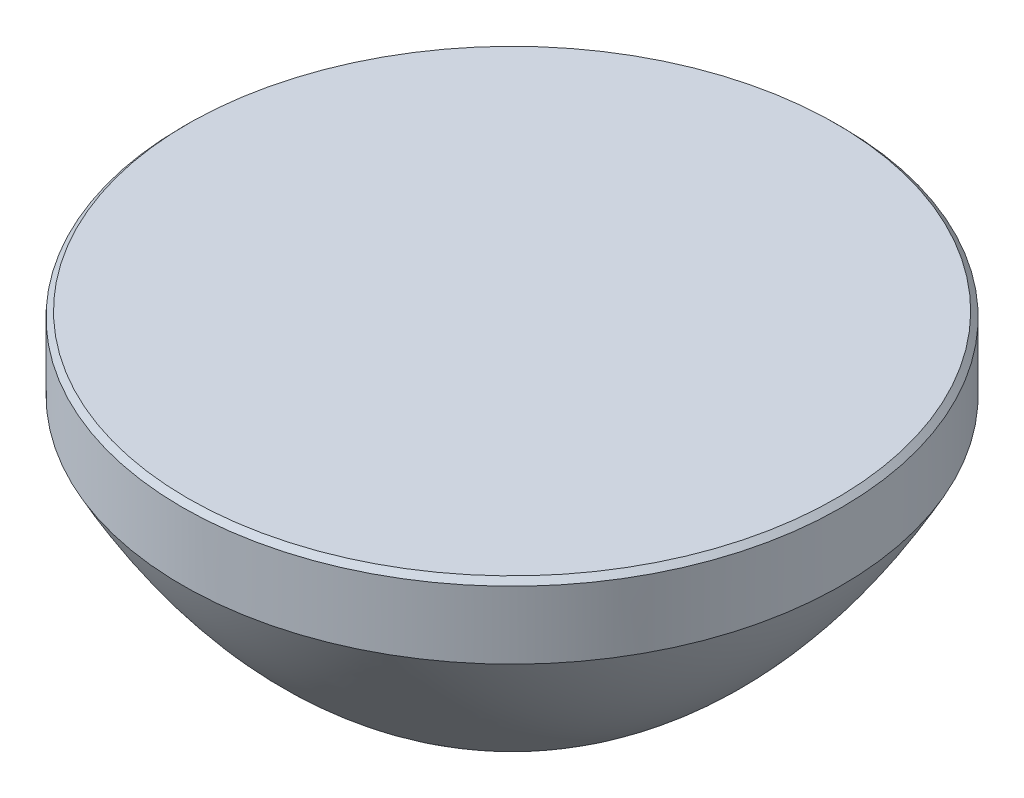
ISO-10303-21;
HEADER;
FILE_DESCRIPTION(('STEP AP214'),'2;1');
FILE_NAME('part.step','',(''),(''),'','','');
FILE_SCHEMA(('AUTOMOTIVE_DESIGN { 1 0 10303 214 1 1 1 1 }'));
ENDSEC;
DATA;
#1=APPLICATION_CONTEXT('core data for automotive mechanical design processes');
#2=APPLICATION_PROTOCOL_DEFINITION('international standard','automotive_design',2000,#1);
#3=PRODUCT_CONTEXT('',#1,'mechanical');
#4=PRODUCT('Part','Part','',(#3));
#5=PRODUCT_RELATED_PRODUCT_CATEGORY('part','',(#4));
#6=PRODUCT_DEFINITION_FORMATION('','',#4);
#7=PRODUCT_DEFINITION_CONTEXT('part definition',#1,'design');
#8=PRODUCT_DEFINITION('design','',#6,#7);
#9=PRODUCT_DEFINITION_SHAPE('','',#8);
#10=(LENGTH_UNIT() NAMED_UNIT(*) SI_UNIT(.MILLI.,.METRE.));
#11=(NAMED_UNIT(*) PLANE_ANGLE_UNIT() SI_UNIT($,.RADIAN.));
#12=(NAMED_UNIT(*) SI_UNIT($,.STERADIAN.) SOLID_ANGLE_UNIT());
#13=UNCERTAINTY_MEASURE_WITH_UNIT(LENGTH_MEASURE(1.E-05),#10,'distance_accuracy_value','');
#14=(GEOMETRIC_REPRESENTATION_CONTEXT(3) GLOBAL_UNCERTAINTY_ASSIGNED_CONTEXT((#13)) GLOBAL_UNIT_ASSIGNED_CONTEXT((#10,
#11,#12)) REPRESENTATION_CONTEXT('',''));
#15=CARTESIAN_POINT('',(0.,0.,0.));
#16=DIRECTION('',(0.,0.,1.));
#17=DIRECTION('',(1.,0.,0.));
#18=AXIS2_PLACEMENT_3D('',#15,#16,#17);
#19=CARTESIAN_POINT('',(0.,-6.,0.));
#20=DIRECTION('',(0.,-1.,0.));
#21=DIRECTION('',(0.,0.,-1.));
#22=AXIS2_PLACEMENT_3D('',#19,#20,#21);
#23=CYLINDRICAL_SURFACE('',#22,12.4999999999542);
#24=CARTESIAN_POINT('',(0.,5.79999999990704,0.));
#25=DIRECTION('',(0.,1.,0.));
#26=DIRECTION('',(0.,0.,1.));
#27=AXIS2_PLACEMENT_3D('',#24,#25,#26);
#28=CIRCLE('',#27,12.4999999999542);
#29=CARTESIAN_POINT('',(0.,5.79999999990704,12.4999999999542));
#30=VERTEX_POINT('',#29);
#31=EDGE_CURVE('E22',#30,#30,#28,.F.);
#32=ORIENTED_EDGE('',*,*,#31,.T.);
#33=EDGE_LOOP('',(#32));
#34=FACE_BOUND('',#33,.T.);
#35=CARTESIAN_POINT('',(0.,3.23934700389114,0.));
#36=DIRECTION('',(0.,-1.,0.));
#37=DIRECTION('',(0.,0.,-1.));
#38=AXIS2_PLACEMENT_3D('',#35,#36,#37);
#39=CIRCLE('',#38,12.5000000000471);
#40=CARTESIAN_POINT('',(0.,3.23934700389114,-12.5000000000471));
#41=VERTEX_POINT('',#40);
#42=EDGE_CURVE('E44',#41,#41,#39,.T.);
#43=ORIENTED_EDGE('',*,*,#42,.F.);
#44=EDGE_LOOP('',(#43));
#45=FACE_BOUND('',#44,.T.);
#46=ADVANCED_FACE('F15',(#34,#45),#23,.T.);
#47=CARTESIAN_POINT('',(0.,-6.,-3.46050642845213E-11));
#48=CARTESIAN_POINT('',(0.,-5.99999999999973,-0.0593874016471057));
#49=CARTESIAN_POINT('',(0.,-5.99875745154061,-0.179102633101388));
#50=CARTESIAN_POINT('',(0.,-5.99316598953807,-0.447284737226659));
#51=CARTESIAN_POINT('',(0.,-5.97826853862149,-0.681285286384628));
#52=CARTESIAN_POINT('',(0.,-5.95595496644944,-0.985920660422897));
#53=CARTESIAN_POINT('',(0.,-5.92626429145968,-1.24818254064179));
#54=CARTESIAN_POINT('',(0.,-5.88924769427204,-1.53401912215417));
#55=CARTESIAN_POINT('',(0.,-5.84496904577684,-1.80484337748082));
#56=CARTESIAN_POINT('',(0.,-5.78063641395423,-2.15088622579916));
#57=CARTESIAN_POINT('',(0.,-5.70446956888396,-2.4897084206026));
#58=CARTESIAN_POINT('',(0.,-5.61670864566699,-2.82878908118954));
#59=CARTESIAN_POINT('',(0.,-5.497832980357,-3.22997293816518));
#60=CARTESIAN_POINT('',(0.,-5.36563707608309,-3.62790804001281));
#61=CARTESIAN_POINT('',(0.,-5.19256716243618,-4.08495822397116));
#62=CARTESIAN_POINT('',(0.,-4.97006789190086,-4.59763385091509));
#63=CARTESIAN_POINT('',(0.,-4.72410573729411,-5.09924468122196));
#64=CARTESIAN_POINT('',(0.,-4.45591821937289,-5.5894576583462));
#65=CARTESIAN_POINT('',(0.,-4.16684394949023,-6.06753110374107));
#66=CARTESIAN_POINT('',(0.,-3.85809528753097,-6.53322597607325));
#67=CARTESIAN_POINT('',(0.,-3.51039124356865,-7.01477660094491));
#68=CARTESIAN_POINT('',(0.,-3.1428188168139,-7.48156996732416));
#69=CARTESIAN_POINT('',(0.,-2.75731099265911,-7.93329158849326));
#70=CARTESIAN_POINT('',(0.,-2.26002758198497,-8.47311526815698));
#71=CARTESIAN_POINT('',(0.,-1.76511428071287,-8.96516406073989));
#72=CARTESIAN_POINT('',(0.,-1.24891157858186,-9.43703070773281));
#73=CARTESIAN_POINT('',(0.,-0.717086172396725,-9.88743755610672));
#74=CARTESIAN_POINT('',(0.,-0.278907477839437,-10.2373740407905));
#75=CARTESIAN_POINT('',(0.,0.2742062053625,-10.6570258925571));
#76=CARTESIAN_POINT('',(0.,0.965880035182499,-11.1438461541893));
#77=CARTESIAN_POINT('',(0.,1.65691398828437,-11.5930418860598));
#78=CARTESIAN_POINT('',(0.,2.33384609215465,-11.9966038909043));
#79=CARTESIAN_POINT('',(0.,2.79526637018834,-12.2584275353516));
#80=CARTESIAN_POINT('',(0.,3.08080243700651,-12.414525241318));
#81=CARTESIAN_POINT('',(0.,3.18700220077768,-12.47194803166));
#82=CARTESIAN_POINT('',(0.,3.23934700389114,-12.5000000000471));
#83=B_SPLINE_CURVE_WITH_KNOTS('',4,(#47,#48,#49,#50,#51,#52,#53,#54,#55,#56,#57,#58,#59,#60,#61,
#62,#63,#64,#65,#66,#67,#68,#69,#70,#71,#72,#73,#74,#75,#76,#77,#78,#79,#80,#81,#82),
.UNSPECIFIED.,.F.,.F.,(5,1,1,1,1,1,1,1,1,1,1,1,1,1,1,1,1,1,1,1,1,1,1,1,1,1,1,1,1,1,1,1,5),
(0.0652284595490682,0.0797670975161495,0.0943057354832309,0.10884437688565,0.123383018288069,
0.137921652832066,0.152460287376063,0.166998928211002,0.181537569045942,0.21061482956746,
0.225153468433428,0.239692107299396,0.26876937330336,0.297846644777614,0.326923925447573,
0.35600118946213,0.385078442300408,0.414155739004842,0.443233007458954,0.472310238104187,
0.508742299542566,0.537819612317455,0.566896925092344,0.625051386982354,0.65412866688307,
0.683205946783786,0.712283243684855,0.741360540585923,0.799514987644447,0.857669541017302,
0.886746931835548,0.901285627244671,0.915824322653794),.UNSPECIFIED.);
#84=CARTESIAN_POINT('',(0.,-6.,0.));
#85=DIRECTION('',(0.,-1.,0.));
#86=AXIS1_PLACEMENT('',#84,#85);
#87=SURFACE_OF_REVOLUTION('',#83,#86);
#88=ORIENTED_EDGE('',*,*,#42,.T.);
#89=EDGE_LOOP('',(#88));
#90=FACE_BOUND('',#89,.T.);
#91=CARTESIAN_POINT('',(0.,-6.,0.));
#92=VERTEX_POINT('',#91);
#93=VERTEX_LOOP('',#92);
#94=FACE_BOUND('',#93,.T.);
#95=ADVANCED_FACE('F25',(#90,#94),#87,.F.);
#96=CARTESIAN_POINT('',(0.,6.,0.));
#97=DIRECTION('',(0.,1.,0.));
#98=DIRECTION('',(0.,0.,1.));
#99=AXIS2_PLACEMENT_3D('',#96,#97,#98);
#100=PLANE('',#99);
#101=CARTESIAN_POINT('',(0.,6.,0.));
#102=DIRECTION('',(0.,1.,0.));
#103=DIRECTION('',(0.,0.,1.));
#104=AXIS2_PLACEMENT_3D('',#101,#102,#103);
#105=CIRCLE('',#104,12.2999999998612);
#106=CARTESIAN_POINT('',(0.,6.,12.2999999998612));
#107=VERTEX_POINT('',#106);
#108=EDGE_CURVE('E10',#107,#107,#105,.T.);
#109=ORIENTED_EDGE('',*,*,#108,.T.);
#110=EDGE_LOOP('',(#109));
#111=FACE_BOUND('',#110,.T.);
#112=ADVANCED_FACE('F27',(#111),#100,.T.);
#113=CARTESIAN_POINT('',(0.,5.79999999990704,0.));
#114=DIRECTION('',(0.,-1.,0.));
#115=DIRECTION('',(0.,0.,-1.));
#116=AXIS2_PLACEMENT_3D('',#113,#114,#115);
#117=CONICAL_SURFACE('',#116,12.4999999999542,0.785398163397448);
#118=ORIENTED_EDGE('',*,*,#108,.F.);
#119=EDGE_LOOP('',(#118));
#120=FACE_BOUND('',#119,.T.);
#121=ORIENTED_EDGE('',*,*,#31,.F.);
#122=EDGE_LOOP('',(#121));
#123=FACE_BOUND('',#122,.T.);
#124=ADVANCED_FACE('F17',(#120,#123),#117,.T.);
#125=CLOSED_SHELL('',(#46,#95,#112,#124));
#126=MANIFOLD_SOLID_BREP('B1',#125);
#127=ADVANCED_BREP_SHAPE_REPRESENTATION('',(#18,#126),#14);
#128=SHAPE_DEFINITION_REPRESENTATION(#9,#127);
ENDSEC;
END-ISO-10303-21;
